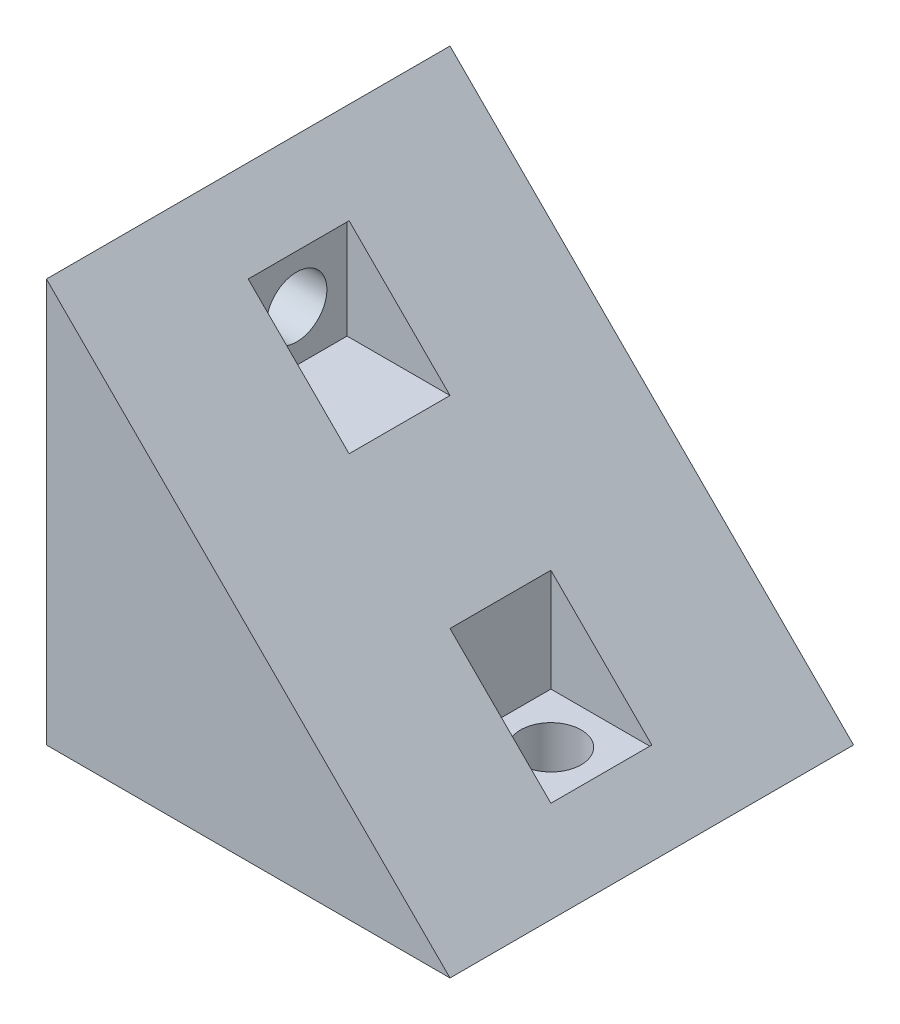
ISO-10303-21;
HEADER;
FILE_DESCRIPTION(('STEP AP214'),'2;1');
FILE_NAME('part.step','',(''),(''),'','','');
FILE_SCHEMA(('AUTOMOTIVE_DESIGN { 1 0 10303 214 1 1 1 1 }'));
ENDSEC;
DATA;
#1=APPLICATION_CONTEXT('core data for automotive mechanical design processes');
#2=APPLICATION_PROTOCOL_DEFINITION('international standard','automotive_design',2000,#1);
#3=PRODUCT_CONTEXT('',#1,'mechanical');
#4=PRODUCT('Part','Part','',(#3));
#5=PRODUCT_RELATED_PRODUCT_CATEGORY('part','',(#4));
#6=PRODUCT_DEFINITION_FORMATION('','',#4);
#7=PRODUCT_DEFINITION_CONTEXT('part definition',#1,'design');
#8=PRODUCT_DEFINITION('design','',#6,#7);
#9=PRODUCT_DEFINITION_SHAPE('','',#8);
#10=(LENGTH_UNIT() NAMED_UNIT(*) SI_UNIT(.MILLI.,.METRE.));
#11=(NAMED_UNIT(*) PLANE_ANGLE_UNIT() SI_UNIT($,.RADIAN.));
#12=(NAMED_UNIT(*) SI_UNIT($,.STERADIAN.) SOLID_ANGLE_UNIT());
#13=UNCERTAINTY_MEASURE_WITH_UNIT(LENGTH_MEASURE(1.E-05),#10,'distance_accuracy_value','');
#14=(GEOMETRIC_REPRESENTATION_CONTEXT(3) GLOBAL_UNCERTAINTY_ASSIGNED_CONTEXT((#13)) GLOBAL_UNIT_ASSIGNED_CONTEXT((#10,
#11,#12)) REPRESENTATION_CONTEXT('',''));
#15=CARTESIAN_POINT('',(0.,0.,0.));
#16=DIRECTION('',(0.,0.,1.));
#17=DIRECTION('',(1.,0.,0.));
#18=AXIS2_PLACEMENT_3D('',#15,#16,#17);
#19=CARTESIAN_POINT('',(30.,40.001,20.));
#20=DIRECTION('',(0.,-1.,0.));
#21=DIRECTION('',(1.,0.,0.));
#22=AXIS2_PLACEMENT_3D('',#19,#20,#21);
#23=CYLINDRICAL_SURFACE('',#22,3.);
#24=CARTESIAN_POINT('',(30.,0.,20.));
#25=DIRECTION('',(0.,-1.,0.));
#26=DIRECTION('',(1.,0.,0.));
#27=AXIS2_PLACEMENT_3D('',#24,#25,#26);
#28=CIRCLE('',#27,3.);
#29=CARTESIAN_POINT('',(33.,0.,20.));
#30=VERTEX_POINT('',#29);
#31=EDGE_CURVE('E228',#30,#30,#28,.T.);
#32=ORIENTED_EDGE('',*,*,#31,.T.);
#33=EDGE_LOOP('',(#32));
#34=FACE_BOUND('',#33,.T.);
#35=CARTESIAN_POINT('',(30.,4.8,20.));
#36=DIRECTION('',(0.,1.,0.));
#37=DIRECTION('',(0.,0.,1.));
#38=AXIS2_PLACEMENT_3D('',#35,#36,#37);
#39=CIRCLE('',#38,3.);
#40=CARTESIAN_POINT('',(30.,4.8,23.));
#41=VERTEX_POINT('',#40);
#42=EDGE_CURVE('E175',#41,#41,#39,.T.);
#43=ORIENTED_EDGE('',*,*,#42,.T.);
#44=EDGE_LOOP('',(#43));
#45=FACE_BOUND('',#44,.T.);
#46=ADVANCED_FACE('F39',(#34,#45),#23,.F.);
#47=CARTESIAN_POINT('',(40.001,30.,20.));
#48=DIRECTION('',(-1.,0.,0.));
#49=DIRECTION('',(0.,0.,1.));
#50=AXIS2_PLACEMENT_3D('',#47,#48,#49);
#51=CYLINDRICAL_SURFACE('',#50,3.);
#52=CARTESIAN_POINT('',(0.,30.,20.));
#53=DIRECTION('',(-1.,0.,0.));
#54=DIRECTION('',(0.,0.,1.));
#55=AXIS2_PLACEMENT_3D('',#52,#53,#54);
#56=CIRCLE('',#55,3.);
#57=CARTESIAN_POINT('',(0.,30.,23.));
#58=VERTEX_POINT('',#57);
#59=EDGE_CURVE('E224',#58,#58,#56,.T.);
#60=ORIENTED_EDGE('',*,*,#59,.T.);
#61=EDGE_LOOP('',(#60));
#62=FACE_BOUND('',#61,.T.);
#63=CARTESIAN_POINT('',(4.8,30.,20.));
#64=DIRECTION('',(1.,0.,0.));
#65=DIRECTION('',(0.,0.,-1.));
#66=AXIS2_PLACEMENT_3D('',#63,#64,#65);
#67=CIRCLE('',#66,3.);
#68=CARTESIAN_POINT('',(4.8,30.,17.));
#69=VERTEX_POINT('',#68);
#70=EDGE_CURVE('E143',#69,#69,#67,.T.);
#71=ORIENTED_EDGE('',*,*,#70,.T.);
#72=EDGE_LOOP('',(#71));
#73=FACE_BOUND('',#72,.T.);
#74=ADVANCED_FACE('F279',(#62,#73),#51,.F.);
#75=CARTESIAN_POINT('',(40.,0.,40.));
#76=DIRECTION('',(0.,1.,0.));
#77=DIRECTION('',(-1.,0.,0.));
#78=AXIS2_PLACEMENT_3D('',#75,#76,#77);
#79=PLANE('',#78);
#80=ORIENTED_EDGE('',*,*,#31,.F.);
#81=EDGE_LOOP('',(#80));
#82=FACE_BOUND('',#81,.T.);
#83=DIRECTION('',(1.,0.,0.));
#84=VECTOR('',#83,1.);
#85=CARTESIAN_POINT('',(40.,0.,0.));
#86=LINE('',#85,#84);
#87=CARTESIAN_POINT('',(0.,0.,0.));
#88=VERTEX_POINT('',#87);
#89=CARTESIAN_POINT('',(40.,0.,0.));
#90=VERTEX_POINT('',#89);
#91=EDGE_CURVE('E232',#88,#90,#86,.T.);
#92=ORIENTED_EDGE('',*,*,#91,.T.);
#93=DIRECTION('',(0.,0.,-1.));
#94=VECTOR('',#93,1.);
#95=CARTESIAN_POINT('',(40.,0.,40.));
#96=LINE('',#95,#94);
#97=CARTESIAN_POINT('',(40.,0.,40.));
#98=VERTEX_POINT('',#97);
#99=EDGE_CURVE('E11',#98,#90,#96,.T.);
#100=ORIENTED_EDGE('',*,*,#99,.F.);
#101=DIRECTION('',(1.,0.,0.));
#102=VECTOR('',#101,1.);
#103=CARTESIAN_POINT('',(40.,0.,40.));
#104=LINE('',#103,#102);
#105=CARTESIAN_POINT('',(0.,0.,40.));
#106=VERTEX_POINT('',#105);
#107=EDGE_CURVE('E233',#106,#98,#104,.T.);
#108=ORIENTED_EDGE('',*,*,#107,.F.);
#109=DIRECTION('',(0.,0.,-1.));
#110=VECTOR('',#109,1.);
#111=CARTESIAN_POINT('',(0.,0.,40.));
#112=LINE('',#111,#110);
#113=EDGE_CURVE('E244',#106,#88,#112,.T.);
#114=ORIENTED_EDGE('',*,*,#113,.T.);
#115=EDGE_LOOP('',(#92,#100,#108,#114));
#116=FACE_BOUND('',#115,.T.);
#117=ADVANCED_FACE('F41',(#82,#116),#79,.F.);
#118=CARTESIAN_POINT('',(0.,40.,40.));
#119=DIRECTION('',(-0.707106781186548,-0.707106781186548,0.));
#120=DIRECTION('',(0.707106781186548,-0.707106781186548,0.));
#121=AXIS2_PLACEMENT_3D('',#118,#119,#120);
#122=PLANE('',#121);
#123=DIRECTION('',(0.,0.,-1.));
#124=VECTOR('',#123,1.);
#125=CARTESIAN_POINT('',(35.,5.,15.));
#126=LINE('',#125,#124);
#127=CARTESIAN_POINT('',(35.,5.,25.));
#128=VERTEX_POINT('',#127);
#129=CARTESIAN_POINT('',(35.,5.00000000000002,15.));
#130=VERTEX_POINT('',#129);
#131=EDGE_CURVE('E149',#128,#130,#126,.T.);
#132=ORIENTED_EDGE('',*,*,#131,.F.);
#133=DIRECTION('',(0.707106781186548,-0.707106781186548,0.));
#134=VECTOR('',#133,1.);
#135=CARTESIAN_POINT('',(17.4995,22.5005,25.));
#136=LINE('',#135,#134);
#137=CARTESIAN_POINT('',(25.,15.,25.));
#138=VERTEX_POINT('',#137);
#139=EDGE_CURVE('E127',#138,#128,#136,.T.);
#140=ORIENTED_EDGE('',*,*,#139,.F.);
#141=DIRECTION('',(0.,0.,1.));
#142=VECTOR('',#141,1.);
#143=CARTESIAN_POINT('',(25.,15.,15.));
#144=LINE('',#143,#142);
#145=CARTESIAN_POINT('',(25.,15.,15.));
#146=VERTEX_POINT('',#145);
#147=EDGE_CURVE('E139',#146,#138,#144,.T.);
#148=ORIENTED_EDGE('',*,*,#147,.F.);
#149=DIRECTION('',(-0.707106781186548,0.707106781186548,0.));
#150=VECTOR('',#149,1.);
#151=CARTESIAN_POINT('',(17.4995,22.5005,15.));
#152=LINE('',#151,#150);
#153=EDGE_CURVE('E55',#130,#146,#152,.T.);
#154=ORIENTED_EDGE('',*,*,#153,.F.);
#155=EDGE_LOOP('',(#132,#140,#148,#154));
#156=FACE_BOUND('',#155,.T.);
#157=DIRECTION('',(0.,0.,-1.));
#158=VECTOR('',#157,1.);
#159=CARTESIAN_POINT('',(15.,25.,15.));
#160=LINE('',#159,#158);
#161=CARTESIAN_POINT('',(15.,25.,25.));
#162=VERTEX_POINT('',#161);
#163=CARTESIAN_POINT('',(15.,25.,15.));
#164=VERTEX_POINT('',#163);
#165=EDGE_CURVE('E181',#162,#164,#160,.T.);
#166=ORIENTED_EDGE('',*,*,#165,.F.);
#167=DIRECTION('',(0.707106781186548,-0.707106781186548,0.));
#168=VECTOR('',#167,1.);
#169=CARTESIAN_POINT('',(27.5005,12.4995,25.));
#170=LINE('',#169,#168);
#171=CARTESIAN_POINT('',(5.,35.,25.));
#172=VERTEX_POINT('',#171);
#173=EDGE_CURVE('E185',#172,#162,#170,.T.);
#174=ORIENTED_EDGE('',*,*,#173,.F.);
#175=DIRECTION('',(0.,0.,1.));
#176=VECTOR('',#175,1.);
#177=CARTESIAN_POINT('',(5.,35.,15.));
#178=LINE('',#177,#176);
#179=CARTESIAN_POINT('',(5.,35.,15.));
#180=VERTEX_POINT('',#179);
#181=EDGE_CURVE('E209',#180,#172,#178,.T.);
#182=ORIENTED_EDGE('',*,*,#181,.F.);
#183=DIRECTION('',(-0.707106781186548,0.707106781186548,0.));
#184=VECTOR('',#183,1.);
#185=CARTESIAN_POINT('',(27.5005,12.4995,15.));
#186=LINE('',#185,#184);
#187=EDGE_CURVE('E63',#164,#180,#186,.T.);
#188=ORIENTED_EDGE('',*,*,#187,.F.);
#189=EDGE_LOOP('',(#166,#174,#182,#188));
#190=FACE_BOUND('',#189,.T.);
#191=DIRECTION('',(-0.707106781186548,0.707106781186548,0.));
#192=VECTOR('',#191,1.);
#193=CARTESIAN_POINT('',(0.,40.,0.));
#194=LINE('',#193,#192);
#195=CARTESIAN_POINT('',(0.,40.,0.));
#196=VERTEX_POINT('',#195);
#197=EDGE_CURVE('E248',#90,#196,#194,.T.);
#198=ORIENTED_EDGE('',*,*,#197,.T.);
#199=DIRECTION('',(0.,0.,-1.));
#200=VECTOR('',#199,1.);
#201=CARTESIAN_POINT('',(0.,40.,40.));
#202=LINE('',#201,#200);
#203=CARTESIAN_POINT('',(0.,40.,40.));
#204=VERTEX_POINT('',#203);
#205=EDGE_CURVE('E48',#204,#196,#202,.T.);
#206=ORIENTED_EDGE('',*,*,#205,.F.);
#207=DIRECTION('',(-0.707106781186548,0.707106781186548,0.));
#208=VECTOR('',#207,1.);
#209=CARTESIAN_POINT('',(0.,40.,40.));
#210=LINE('',#209,#208);
#211=EDGE_CURVE('E237',#98,#204,#210,.T.);
#212=ORIENTED_EDGE('',*,*,#211,.F.);
#213=ORIENTED_EDGE('',*,*,#99,.T.);
#214=EDGE_LOOP('',(#198,#206,#212,#213));
#215=FACE_BOUND('',#214,.T.);
#216=ADVANCED_FACE('F146',(#156,#190,#215),#122,.F.);
#217=CARTESIAN_POINT('',(0.,0.,40.));
#218=DIRECTION('',(1.,0.,0.));
#219=DIRECTION('',(0.,0.,-1.));
#220=AXIS2_PLACEMENT_3D('',#217,#218,#219);
#221=PLANE('',#220);
#222=ORIENTED_EDGE('',*,*,#59,.F.);
#223=EDGE_LOOP('',(#222));
#224=FACE_BOUND('',#223,.T.);
#225=DIRECTION('',(0.,-1.,0.));
#226=VECTOR('',#225,1.);
#227=CARTESIAN_POINT('',(0.,0.,0.));
#228=LINE('',#227,#226);
#229=EDGE_CURVE('E238',#196,#88,#228,.T.);
#230=ORIENTED_EDGE('',*,*,#229,.T.);
#231=ORIENTED_EDGE('',*,*,#113,.F.);
#232=DIRECTION('',(0.,-1.,0.));
#233=VECTOR('',#232,1.);
#234=CARTESIAN_POINT('',(0.,0.,40.));
#235=LINE('',#234,#233);
#236=EDGE_CURVE('E241',#204,#106,#235,.T.);
#237=ORIENTED_EDGE('',*,*,#236,.F.);
#238=ORIENTED_EDGE('',*,*,#205,.T.);
#239=EDGE_LOOP('',(#230,#231,#237,#238));
#240=FACE_BOUND('',#239,.T.);
#241=ADVANCED_FACE('F261',(#224,#240),#221,.F.);
#242=CARTESIAN_POINT('',(0.,0.,40.));
#243=DIRECTION('',(0.,0.,-1.));
#244=DIRECTION('',(-1.,0.,0.));
#245=AXIS2_PLACEMENT_3D('',#242,#243,#244);
#246=PLANE('',#245);
#247=ORIENTED_EDGE('',*,*,#107,.T.);
#248=ORIENTED_EDGE('',*,*,#211,.T.);
#249=ORIENTED_EDGE('',*,*,#236,.T.);
#250=EDGE_LOOP('',(#247,#248,#249));
#251=FACE_BOUND('',#250,.T.);
#252=ADVANCED_FACE('F271',(#251),#246,.F.);
#253=CARTESIAN_POINT('',(0.,0.,0.));
#254=DIRECTION('',(0.,0.,-1.));
#255=DIRECTION('',(-1.,0.,0.));
#256=AXIS2_PLACEMENT_3D('',#253,#254,#255);
#257=PLANE('',#256);
#258=ORIENTED_EDGE('',*,*,#91,.F.);
#259=ORIENTED_EDGE('',*,*,#229,.F.);
#260=ORIENTED_EDGE('',*,*,#197,.F.);
#261=EDGE_LOOP('',(#258,#259,#260));
#262=FACE_BOUND('',#261,.T.);
#263=ADVANCED_FACE('F266',(#262),#257,.T.);
#264=CARTESIAN_POINT('',(40.001,25.,25.));
#265=DIRECTION('',(0.,0.,1.));
#266=DIRECTION('',(1.,0.,0.));
#267=AXIS2_PLACEMENT_3D('',#264,#265,#266);
#268=PLANE('',#267);
#269=ORIENTED_EDGE('',*,*,#173,.T.);
#270=DIRECTION('',(-1.,0.,0.));
#271=VECTOR('',#270,1.);
#272=CARTESIAN_POINT('',(40.001,25.,25.));
#273=LINE('',#272,#271);
#274=CARTESIAN_POINT('',(4.8,25.,25.));
#275=VERTEX_POINT('',#274);
#276=EDGE_CURVE('E206',#162,#275,#273,.T.);
#277=ORIENTED_EDGE('',*,*,#276,.T.);
#278=DIRECTION('',(0.,1.,0.));
#279=VECTOR('',#278,1.);
#280=CARTESIAN_POINT('',(4.8,25.,25.));
#281=LINE('',#280,#279);
#282=CARTESIAN_POINT('',(4.8,35.,25.));
#283=VERTEX_POINT('',#282);
#284=EDGE_CURVE('E189',#275,#283,#281,.T.);
#285=ORIENTED_EDGE('',*,*,#284,.T.);
#286=DIRECTION('',(-1.,0.,0.));
#287=VECTOR('',#286,1.);
#288=CARTESIAN_POINT('',(40.001,35.,25.));
#289=LINE('',#288,#287);
#290=EDGE_CURVE('E205',#172,#283,#289,.T.);
#291=ORIENTED_EDGE('',*,*,#290,.F.);
#292=EDGE_LOOP('',(#269,#277,#285,#291));
#293=FACE_BOUND('',#292,.T.);
#294=ADVANCED_FACE('F295',(#293),#268,.F.);
#295=CARTESIAN_POINT('',(40.001,25.,15.));
#296=DIRECTION('',(0.,-1.,0.));
#297=DIRECTION('',(0.,0.,-1.));
#298=AXIS2_PLACEMENT_3D('',#295,#296,#297);
#299=PLANE('',#298);
#300=ORIENTED_EDGE('',*,*,#165,.T.);
#301=DIRECTION('',(-1.,0.,0.));
#302=VECTOR('',#301,1.);
#303=CARTESIAN_POINT('',(40.001,25.,15.));
#304=LINE('',#303,#302);
#305=CARTESIAN_POINT('',(4.8,25.,15.));
#306=VERTEX_POINT('',#305);
#307=EDGE_CURVE('E210',#164,#306,#304,.T.);
#308=ORIENTED_EDGE('',*,*,#307,.T.);
#309=DIRECTION('',(0.,0.,1.));
#310=VECTOR('',#309,1.);
#311=CARTESIAN_POINT('',(4.8,25.,15.));
#312=LINE('',#311,#310);
#313=EDGE_CURVE('E201',#306,#275,#312,.T.);
#314=ORIENTED_EDGE('',*,*,#313,.T.);
#315=ORIENTED_EDGE('',*,*,#276,.F.);
#316=EDGE_LOOP('',(#300,#308,#314,#315));
#317=FACE_BOUND('',#316,.T.);
#318=ADVANCED_FACE('F299',(#317),#299,.F.);
#319=CARTESIAN_POINT('',(40.001,25.,15.));
#320=DIRECTION('',(0.,0.,-1.));
#321=DIRECTION('',(-1.,0.,0.));
#322=AXIS2_PLACEMENT_3D('',#319,#320,#321);
#323=PLANE('',#322);
#324=ORIENTED_EDGE('',*,*,#187,.T.);
#325=DIRECTION('',(-1.,0.,0.));
#326=VECTOR('',#325,1.);
#327=CARTESIAN_POINT('',(40.001,35.,15.));
#328=LINE('',#327,#326);
#329=CARTESIAN_POINT('',(4.8,35.,15.));
#330=VERTEX_POINT('',#329);
#331=EDGE_CURVE('E213',#180,#330,#328,.T.);
#332=ORIENTED_EDGE('',*,*,#331,.T.);
#333=DIRECTION('',(0.,-1.,0.));
#334=VECTOR('',#333,1.);
#335=CARTESIAN_POINT('',(4.8,25.,15.));
#336=LINE('',#335,#334);
#337=EDGE_CURVE('E197',#330,#306,#336,.T.);
#338=ORIENTED_EDGE('',*,*,#337,.T.);
#339=ORIENTED_EDGE('',*,*,#307,.F.);
#340=EDGE_LOOP('',(#324,#332,#338,#339));
#341=FACE_BOUND('',#340,.T.);
#342=ADVANCED_FACE('F304',(#341),#323,.F.);
#343=CARTESIAN_POINT('',(40.001,35.,15.));
#344=DIRECTION('',(0.,1.,0.));
#345=DIRECTION('',(0.,0.,1.));
#346=AXIS2_PLACEMENT_3D('',#343,#344,#345);
#347=PLANE('',#346);
#348=ORIENTED_EDGE('',*,*,#181,.T.);
#349=ORIENTED_EDGE('',*,*,#290,.T.);
#350=DIRECTION('',(0.,0.,-1.));
#351=VECTOR('',#350,1.);
#352=CARTESIAN_POINT('',(4.8,35.,15.));
#353=LINE('',#352,#351);
#354=EDGE_CURVE('E193',#283,#330,#353,.T.);
#355=ORIENTED_EDGE('',*,*,#354,.T.);
#356=ORIENTED_EDGE('',*,*,#331,.F.);
#357=EDGE_LOOP('',(#348,#349,#355,#356));
#358=FACE_BOUND('',#357,.T.);
#359=ADVANCED_FACE('F308',(#358),#347,.F.);
#360=CARTESIAN_POINT('',(4.8,0.,0.));
#361=DIRECTION('',(1.,0.,0.));
#362=DIRECTION('',(0.,0.,-1.));
#363=AXIS2_PLACEMENT_3D('',#360,#361,#362);
#364=PLANE('',#363);
#365=ORIENTED_EDGE('',*,*,#70,.F.);
#366=EDGE_LOOP('',(#365));
#367=FACE_BOUND('',#366,.T.);
#368=ORIENTED_EDGE('',*,*,#284,.F.);
#369=ORIENTED_EDGE('',*,*,#313,.F.);
#370=ORIENTED_EDGE('',*,*,#337,.F.);
#371=ORIENTED_EDGE('',*,*,#354,.F.);
#372=EDGE_LOOP('',(#368,#369,#370,#371));
#373=FACE_BOUND('',#372,.T.);
#374=ADVANCED_FACE('F311',(#367,#373),#364,.T.);
#375=CARTESIAN_POINT('',(35.,40.001,25.));
#376=DIRECTION('',(0.,0.,1.));
#377=DIRECTION('',(1.,0.,0.));
#378=AXIS2_PLACEMENT_3D('',#375,#376,#377);
#379=PLANE('',#378);
#380=ORIENTED_EDGE('',*,*,#139,.T.);
#381=DIRECTION('',(0.,-1.,0.));
#382=VECTOR('',#381,1.);
#383=CARTESIAN_POINT('',(35.,40.001,25.));
#384=LINE('',#383,#382);
#385=CARTESIAN_POINT('',(35.,4.8,25.));
#386=VERTEX_POINT('',#385);
#387=EDGE_CURVE('E144',#128,#386,#384,.T.);
#388=ORIENTED_EDGE('',*,*,#387,.T.);
#389=DIRECTION('',(-1.,0.,0.));
#390=VECTOR('',#389,1.);
#391=CARTESIAN_POINT('',(35.,4.8,25.));
#392=LINE('',#391,#390);
#393=CARTESIAN_POINT('',(25.,4.8,25.));
#394=VERTEX_POINT('',#393);
#395=EDGE_CURVE('E130',#386,#394,#392,.T.);
#396=ORIENTED_EDGE('',*,*,#395,.T.);
#397=DIRECTION('',(0.,-1.,0.));
#398=VECTOR('',#397,1.);
#399=CARTESIAN_POINT('',(25.,40.001,25.));
#400=LINE('',#399,#398);
#401=EDGE_CURVE('E123',#138,#394,#400,.T.);
#402=ORIENTED_EDGE('',*,*,#401,.F.);
#403=EDGE_LOOP('',(#380,#388,#396,#402));
#404=FACE_BOUND('',#403,.T.);
#405=ADVANCED_FACE('F125',(#404),#379,.F.);
#406=CARTESIAN_POINT('',(35.,40.001,15.));
#407=DIRECTION('',(1.,0.,0.));
#408=DIRECTION('',(0.,1.,0.));
#409=AXIS2_PLACEMENT_3D('',#406,#407,#408);
#410=PLANE('',#409);
#411=ORIENTED_EDGE('',*,*,#131,.T.);
#412=DIRECTION('',(0.,-1.,0.));
#413=VECTOR('',#412,1.);
#414=CARTESIAN_POINT('',(35.,40.001,15.));
#415=LINE('',#414,#413);
#416=CARTESIAN_POINT('',(35.,4.8,15.));
#417=VERTEX_POINT('',#416);
#418=EDGE_CURVE('E170',#130,#417,#415,.T.);
#419=ORIENTED_EDGE('',*,*,#418,.T.);
#420=DIRECTION('',(0.,0.,1.));
#421=VECTOR('',#420,1.);
#422=CARTESIAN_POINT('',(35.,4.8,15.));
#423=LINE('',#422,#421);
#424=EDGE_CURVE('E136',#417,#386,#423,.T.);
#425=ORIENTED_EDGE('',*,*,#424,.T.);
#426=ORIENTED_EDGE('',*,*,#387,.F.);
#427=EDGE_LOOP('',(#411,#419,#425,#426));
#428=FACE_BOUND('',#427,.T.);
#429=ADVANCED_FACE('F320',(#428),#410,.F.);
#430=CARTESIAN_POINT('',(35.,40.001,15.));
#431=DIRECTION('',(0.,0.,-1.));
#432=DIRECTION('',(-1.,0.,0.));
#433=AXIS2_PLACEMENT_3D('',#430,#431,#432);
#434=PLANE('',#433);
#435=ORIENTED_EDGE('',*,*,#153,.T.);
#436=DIRECTION('',(0.,-1.,0.));
#437=VECTOR('',#436,1.);
#438=CARTESIAN_POINT('',(25.,40.001,15.));
#439=LINE('',#438,#437);
#440=CARTESIAN_POINT('',(25.,4.8,15.));
#441=VERTEX_POINT('',#440);
#442=EDGE_CURVE('E135',#146,#441,#439,.T.);
#443=ORIENTED_EDGE('',*,*,#442,.T.);
#444=DIRECTION('',(1.,0.,0.));
#445=VECTOR('',#444,1.);
#446=CARTESIAN_POINT('',(35.,4.8,15.));
#447=LINE('',#446,#445);
#448=EDGE_CURVE('E161',#441,#417,#447,.T.);
#449=ORIENTED_EDGE('',*,*,#448,.T.);
#450=ORIENTED_EDGE('',*,*,#418,.F.);
#451=EDGE_LOOP('',(#435,#443,#449,#450));
#452=FACE_BOUND('',#451,.T.);
#453=ADVANCED_FACE('F324',(#452),#434,.F.);
#454=CARTESIAN_POINT('',(25.,40.001,15.));
#455=DIRECTION('',(-1.,0.,0.));
#456=DIRECTION('',(0.,-1.,0.));
#457=AXIS2_PLACEMENT_3D('',#454,#455,#456);
#458=PLANE('',#457);
#459=ORIENTED_EDGE('',*,*,#147,.T.);
#460=ORIENTED_EDGE('',*,*,#401,.T.);
#461=DIRECTION('',(0.,0.,-1.));
#462=VECTOR('',#461,1.);
#463=CARTESIAN_POINT('',(25.,4.8,15.));
#464=LINE('',#463,#462);
#465=EDGE_CURVE('E154',#394,#441,#464,.T.);
#466=ORIENTED_EDGE('',*,*,#465,.T.);
#467=ORIENTED_EDGE('',*,*,#442,.F.);
#468=EDGE_LOOP('',(#459,#460,#466,#467));
#469=FACE_BOUND('',#468,.T.);
#470=ADVANCED_FACE('F140',(#469),#458,.F.);
#471=CARTESIAN_POINT('',(0.,4.8,0.));
#472=DIRECTION('',(0.,1.,0.));
#473=DIRECTION('',(0.,0.,1.));
#474=AXIS2_PLACEMENT_3D('',#471,#472,#473);
#475=PLANE('',#474);
#476=ORIENTED_EDGE('',*,*,#42,.F.);
#477=EDGE_LOOP('',(#476));
#478=FACE_BOUND('',#477,.T.);
#479=ORIENTED_EDGE('',*,*,#395,.F.);
#480=ORIENTED_EDGE('',*,*,#424,.F.);
#481=ORIENTED_EDGE('',*,*,#448,.F.);
#482=ORIENTED_EDGE('',*,*,#465,.F.);
#483=EDGE_LOOP('',(#479,#480,#481,#482));
#484=FACE_BOUND('',#483,.T.);
#485=ADVANCED_FACE('F323',(#478,#484),#475,.T.);
#486=CLOSED_SHELL('',(#46,#74,#117,#216,#241,#252,#263,#294,#318,#342,#359,#374,#405,#429,#453,
#470,#485));
#487=MANIFOLD_SOLID_BREP('B2',#486);
#488=ADVANCED_BREP_SHAPE_REPRESENTATION('',(#18,#487),#14);
#489=SHAPE_DEFINITION_REPRESENTATION(#9,#488);
ENDSEC;
END-ISO-10303-21;
